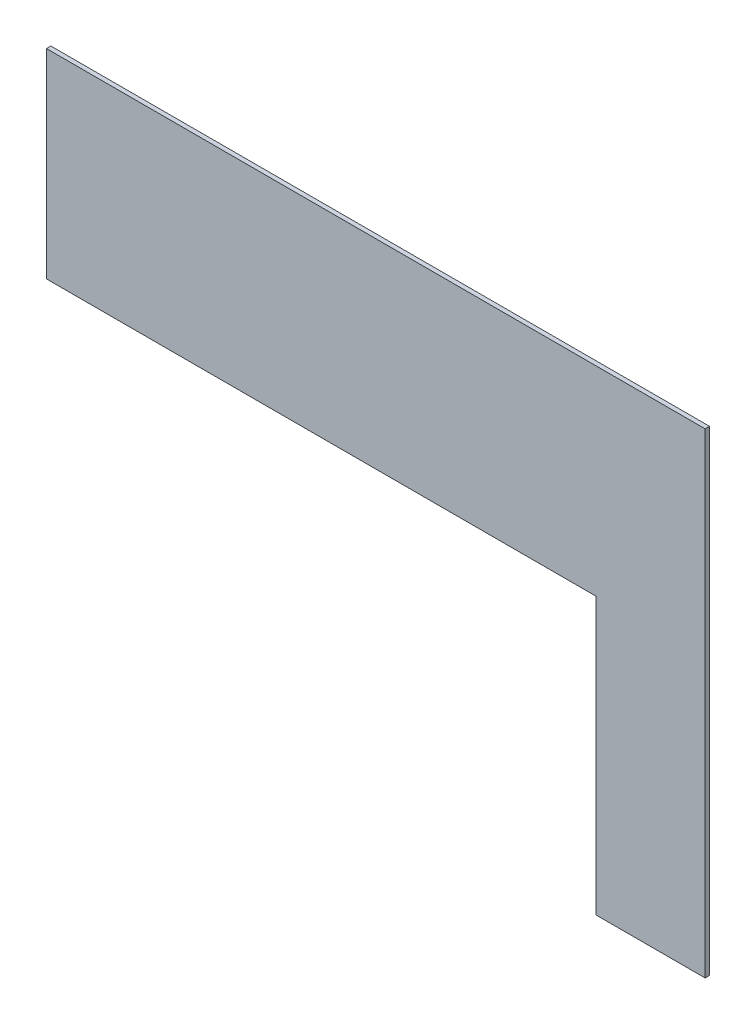
ISO-10303-21;
HEADER;
FILE_DESCRIPTION(('STEP AP214'),'2;1');
FILE_NAME('part.step','',(''),(''),'','','');
FILE_SCHEMA(('AUTOMOTIVE_DESIGN { 1 0 10303 214 1 1 1 1 }'));
ENDSEC;
DATA;
#1=APPLICATION_CONTEXT('core data for automotive mechanical design processes');
#2=APPLICATION_PROTOCOL_DEFINITION('international standard','automotive_design',2000,#1);
#3=PRODUCT_CONTEXT('',#1,'mechanical');
#4=PRODUCT('Part','Part','',(#3));
#5=PRODUCT_RELATED_PRODUCT_CATEGORY('part','',(#4));
#6=PRODUCT_DEFINITION_FORMATION('','',#4);
#7=PRODUCT_DEFINITION_CONTEXT('part definition',#1,'design');
#8=PRODUCT_DEFINITION('design','',#6,#7);
#9=PRODUCT_DEFINITION_SHAPE('','',#8);
#10=(LENGTH_UNIT() NAMED_UNIT(*) SI_UNIT(.MILLI.,.METRE.));
#11=(NAMED_UNIT(*) PLANE_ANGLE_UNIT() SI_UNIT($,.RADIAN.));
#12=(NAMED_UNIT(*) SI_UNIT($,.STERADIAN.) SOLID_ANGLE_UNIT());
#13=UNCERTAINTY_MEASURE_WITH_UNIT(LENGTH_MEASURE(1.E-05),#10,'distance_accuracy_value','');
#14=(GEOMETRIC_REPRESENTATION_CONTEXT(3) GLOBAL_UNCERTAINTY_ASSIGNED_CONTEXT((#13)) GLOBAL_UNIT_ASSIGNED_CONTEXT((#10,
#11,#12)) REPRESENTATION_CONTEXT('',''));
#15=CARTESIAN_POINT('',(0.,0.,0.));
#16=DIRECTION('',(0.,0.,1.));
#17=DIRECTION('',(1.,0.,0.));
#18=AXIS2_PLACEMENT_3D('',#15,#16,#17);
#19=CARTESIAN_POINT('',(0.,-365.,-8.));
#20=DIRECTION('',(-1.,0.,0.));
#21=DIRECTION('',(0.,0.,1.));
#22=AXIS2_PLACEMENT_3D('',#19,#20,#21);
#23=PLANE('',#22);
#24=DIRECTION('',(0.,-1.,0.));
#25=VECTOR('',#24,1.);
#26=CARTESIAN_POINT('',(0.,-365.,0.));
#27=LINE('',#26,#25);
#28=CARTESIAN_POINT('',(0.,0.,0.));
#29=VERTEX_POINT('',#28);
#30=CARTESIAN_POINT('',(0.,-365.,0.));
#31=VERTEX_POINT('',#30);
#32=EDGE_CURVE('E123',#29,#31,#27,.T.);
#33=ORIENTED_EDGE('',*,*,#32,.F.);
#34=DIRECTION('',(0.,0.,1.));
#35=VECTOR('',#34,1.);
#36=CARTESIAN_POINT('',(0.,0.,-8.));
#37=LINE('',#36,#35);
#38=CARTESIAN_POINT('',(0.,0.,-8.));
#39=VERTEX_POINT('',#38);
#40=EDGE_CURVE('E11',#39,#29,#37,.T.);
#41=ORIENTED_EDGE('',*,*,#40,.F.);
#42=DIRECTION('',(0.,-1.,0.));
#43=VECTOR('',#42,1.);
#44=CARTESIAN_POINT('',(0.,-365.,-8.));
#45=LINE('',#44,#43);
#46=CARTESIAN_POINT('',(0.,-365.,-8.));
#47=VERTEX_POINT('',#46);
#48=EDGE_CURVE('E137',#39,#47,#45,.T.);
#49=ORIENTED_EDGE('',*,*,#48,.T.);
#50=DIRECTION('',(0.,0.,1.));
#51=VECTOR('',#50,1.);
#52=CARTESIAN_POINT('',(0.,-365.,-8.));
#53=LINE('',#52,#51);
#54=EDGE_CURVE('E41',#47,#31,#53,.T.);
#55=ORIENTED_EDGE('',*,*,#54,.T.);
#56=EDGE_LOOP('',(#33,#41,#49,#55));
#57=FACE_BOUND('',#56,.T.);
#58=ADVANCED_FACE('F38',(#57),#23,.T.);
#59=CARTESIAN_POINT('',(0.,0.,-8.));
#60=DIRECTION('',(0.,1.,0.));
#61=DIRECTION('',(0.,0.,1.));
#62=AXIS2_PLACEMENT_3D('',#59,#60,#61);
#63=PLANE('',#62);
#64=DIRECTION('',(-1.,0.,0.));
#65=VECTOR('',#64,1.);
#66=CARTESIAN_POINT('',(0.,0.,0.));
#67=LINE('',#66,#65);
#68=CARTESIAN_POINT('',(1205.,0.,0.));
#69=VERTEX_POINT('',#68);
#70=EDGE_CURVE('E135',#69,#29,#67,.T.);
#71=ORIENTED_EDGE('',*,*,#70,.F.);
#72=DIRECTION('',(0.,0.,1.));
#73=VECTOR('',#72,1.);
#74=CARTESIAN_POINT('',(1205.,0.,-8.));
#75=LINE('',#74,#73);
#76=CARTESIAN_POINT('',(1205.,0.,-8.));
#77=VERTEX_POINT('',#76);
#78=EDGE_CURVE('E47',#77,#69,#75,.T.);
#79=ORIENTED_EDGE('',*,*,#78,.F.);
#80=DIRECTION('',(-1.,0.,0.));
#81=VECTOR('',#80,1.);
#82=CARTESIAN_POINT('',(0.,0.,-8.));
#83=LINE('',#82,#81);
#84=EDGE_CURVE('E113',#77,#39,#83,.T.);
#85=ORIENTED_EDGE('',*,*,#84,.T.);
#86=ORIENTED_EDGE('',*,*,#40,.T.);
#87=EDGE_LOOP('',(#71,#79,#85,#86));
#88=FACE_BOUND('',#87,.T.);
#89=ADVANCED_FACE('F145',(#88),#63,.T.);
#90=CARTESIAN_POINT('',(1205.,0.,-8.));
#91=DIRECTION('',(1.,0.,0.));
#92=DIRECTION('',(0.,1.,0.));
#93=AXIS2_PLACEMENT_3D('',#90,#91,#92);
#94=PLANE('',#93);
#95=DIRECTION('',(0.,1.,0.));
#96=VECTOR('',#95,1.);
#97=CARTESIAN_POINT('',(1205.,0.,0.));
#98=LINE('',#97,#96);
#99=CARTESIAN_POINT('',(1205.,-870.,0.));
#100=VERTEX_POINT('',#99);
#101=EDGE_CURVE('E100',#100,#69,#98,.T.);
#102=ORIENTED_EDGE('',*,*,#101,.F.);
#103=DIRECTION('',(0.,0.,1.));
#104=VECTOR('',#103,1.);
#105=CARTESIAN_POINT('',(1205.,-870.,-8.));
#106=LINE('',#105,#104);
#107=CARTESIAN_POINT('',(1205.,-870.,-8.));
#108=VERTEX_POINT('',#107);
#109=EDGE_CURVE('E95',#108,#100,#106,.T.);
#110=ORIENTED_EDGE('',*,*,#109,.F.);
#111=DIRECTION('',(0.,1.,0.));
#112=VECTOR('',#111,1.);
#113=CARTESIAN_POINT('',(1205.,0.,-8.));
#114=LINE('',#113,#112);
#115=EDGE_CURVE('E98',#108,#77,#114,.T.);
#116=ORIENTED_EDGE('',*,*,#115,.T.);
#117=ORIENTED_EDGE('',*,*,#78,.T.);
#118=EDGE_LOOP('',(#102,#110,#116,#117));
#119=FACE_BOUND('',#118,.T.);
#120=ADVANCED_FACE('F97',(#119),#94,.T.);
#121=CARTESIAN_POINT('',(1205.,-870.,-8.));
#122=DIRECTION('',(0.,-1.,0.));
#123=DIRECTION('',(1.,0.,0.));
#124=AXIS2_PLACEMENT_3D('',#121,#122,#123);
#125=PLANE('',#124);
#126=DIRECTION('',(1.,0.,0.));
#127=VECTOR('',#126,1.);
#128=CARTESIAN_POINT('',(1205.,-870.,0.));
#129=LINE('',#128,#127);
#130=CARTESIAN_POINT('',(1005.,-870.,0.));
#131=VERTEX_POINT('',#130);
#132=EDGE_CURVE('E132',#131,#100,#129,.T.);
#133=ORIENTED_EDGE('',*,*,#132,.F.);
#134=DIRECTION('',(0.,0.,1.));
#135=VECTOR('',#134,1.);
#136=CARTESIAN_POINT('',(1005.,-870.,-8.));
#137=LINE('',#136,#135);
#138=CARTESIAN_POINT('',(1005.,-870.,-8.));
#139=VERTEX_POINT('',#138);
#140=EDGE_CURVE('E105',#139,#131,#137,.T.);
#141=ORIENTED_EDGE('',*,*,#140,.F.);
#142=DIRECTION('',(1.,0.,0.));
#143=VECTOR('',#142,1.);
#144=CARTESIAN_POINT('',(1205.,-870.,-8.));
#145=LINE('',#144,#143);
#146=EDGE_CURVE('E111',#139,#108,#145,.T.);
#147=ORIENTED_EDGE('',*,*,#146,.T.);
#148=ORIENTED_EDGE('',*,*,#109,.T.);
#149=EDGE_LOOP('',(#133,#141,#147,#148));
#150=FACE_BOUND('',#149,.T.);
#151=ADVANCED_FACE('F115',(#150),#125,.T.);
#152=CARTESIAN_POINT('',(1005.,-870.,-8.));
#153=DIRECTION('',(-1.,0.,0.));
#154=DIRECTION('',(0.,0.,1.));
#155=AXIS2_PLACEMENT_3D('',#152,#153,#154);
#156=PLANE('',#155);
#157=DIRECTION('',(0.,-1.,0.));
#158=VECTOR('',#157,1.);
#159=CARTESIAN_POINT('',(1005.,-870.,0.));
#160=LINE('',#159,#158);
#161=CARTESIAN_POINT('',(1005.,-365.,0.));
#162=VERTEX_POINT('',#161);
#163=EDGE_CURVE('E129',#162,#131,#160,.T.);
#164=ORIENTED_EDGE('',*,*,#163,.F.);
#165=DIRECTION('',(0.,0.,1.));
#166=VECTOR('',#165,1.);
#167=CARTESIAN_POINT('',(1005.,-365.,-8.));
#168=LINE('',#167,#166);
#169=CARTESIAN_POINT('',(1005.,-365.,-8.));
#170=VERTEX_POINT('',#169);
#171=EDGE_CURVE('E140',#170,#162,#168,.T.);
#172=ORIENTED_EDGE('',*,*,#171,.F.);
#173=DIRECTION('',(0.,-1.,0.));
#174=VECTOR('',#173,1.);
#175=CARTESIAN_POINT('',(1005.,-870.,-8.));
#176=LINE('',#175,#174);
#177=EDGE_CURVE('E116',#170,#139,#176,.T.);
#178=ORIENTED_EDGE('',*,*,#177,.T.);
#179=ORIENTED_EDGE('',*,*,#140,.T.);
#180=EDGE_LOOP('',(#164,#172,#178,#179));
#181=FACE_BOUND('',#180,.T.);
#182=ADVANCED_FACE('F158',(#181),#156,.T.);
#183=CARTESIAN_POINT('',(1005.,-365.,-8.));
#184=DIRECTION('',(0.,-1.,0.));
#185=DIRECTION('',(1.,0.,0.));
#186=AXIS2_PLACEMENT_3D('',#183,#184,#185);
#187=PLANE('',#186);
#188=DIRECTION('',(1.,0.,0.));
#189=VECTOR('',#188,1.);
#190=CARTESIAN_POINT('',(1005.,-365.,0.));
#191=LINE('',#190,#189);
#192=EDGE_CURVE('E126',#31,#162,#191,.T.);
#193=ORIENTED_EDGE('',*,*,#192,.F.);
#194=ORIENTED_EDGE('',*,*,#54,.F.);
#195=DIRECTION('',(1.,0.,0.));
#196=VECTOR('',#195,1.);
#197=CARTESIAN_POINT('',(1005.,-365.,-8.));
#198=LINE('',#197,#196);
#199=EDGE_CURVE('E118',#47,#170,#198,.T.);
#200=ORIENTED_EDGE('',*,*,#199,.T.);
#201=ORIENTED_EDGE('',*,*,#171,.T.);
#202=EDGE_LOOP('',(#193,#194,#200,#201));
#203=FACE_BOUND('',#202,.T.);
#204=ADVANCED_FACE('F142',(#203),#187,.T.);
#205=CARTESIAN_POINT('',(0.,0.,-8.));
#206=DIRECTION('',(0.,0.,-1.));
#207=DIRECTION('',(-1.,0.,0.));
#208=AXIS2_PLACEMENT_3D('',#205,#206,#207);
#209=PLANE('',#208);
#210=ORIENTED_EDGE('',*,*,#48,.F.);
#211=ORIENTED_EDGE('',*,*,#84,.F.);
#212=ORIENTED_EDGE('',*,*,#115,.F.);
#213=ORIENTED_EDGE('',*,*,#146,.F.);
#214=ORIENTED_EDGE('',*,*,#177,.F.);
#215=ORIENTED_EDGE('',*,*,#199,.F.);
#216=EDGE_LOOP('',(#210,#211,#212,#213,#214,#215));
#217=FACE_BOUND('',#216,.T.);
#218=ADVANCED_FACE('F109',(#217),#209,.T.);
#219=CARTESIAN_POINT('',(0.,0.,0.));
#220=DIRECTION('',(0.,0.,-1.));
#221=DIRECTION('',(-1.,0.,0.));
#222=AXIS2_PLACEMENT_3D('',#219,#220,#221);
#223=PLANE('',#222);
#224=ORIENTED_EDGE('',*,*,#32,.T.);
#225=ORIENTED_EDGE('',*,*,#192,.T.);
#226=ORIENTED_EDGE('',*,*,#163,.T.);
#227=ORIENTED_EDGE('',*,*,#132,.T.);
#228=ORIENTED_EDGE('',*,*,#101,.T.);
#229=ORIENTED_EDGE('',*,*,#70,.T.);
#230=EDGE_LOOP('',(#224,#225,#226,#227,#228,#229));
#231=FACE_BOUND('',#230,.T.);
#232=ADVANCED_FACE('F144',(#231),#223,.F.);
#233=CLOSED_SHELL('',(#58,#89,#120,#151,#182,#204,#218,#232));
#234=MANIFOLD_SOLID_BREP('B2',#233);
#235=ADVANCED_BREP_SHAPE_REPRESENTATION('',(#18,#234),#14);
#236=SHAPE_DEFINITION_REPRESENTATION(#9,#235);
ENDSEC;
END-ISO-10303-21;
